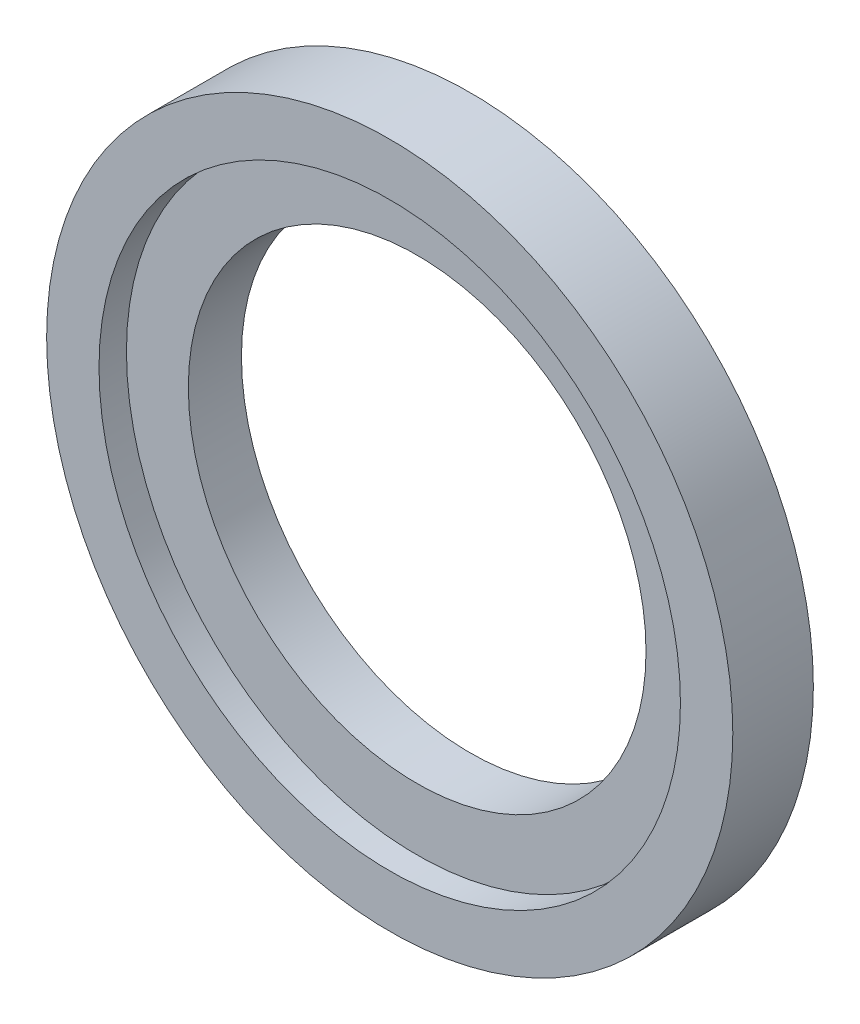
ISO-10303-21;
HEADER;
FILE_DESCRIPTION(('STEP AP214'),'2;1');
FILE_NAME('part.step','',(''),(''),'','','');
FILE_SCHEMA(('AUTOMOTIVE_DESIGN { 1 0 10303 214 1 1 1 1 }'));
ENDSEC;
DATA;
#1=APPLICATION_CONTEXT('core data for automotive mechanical design processes');
#2=APPLICATION_PROTOCOL_DEFINITION('international standard','automotive_design',2000,#1);
#3=PRODUCT_CONTEXT('',#1,'mechanical');
#4=PRODUCT('Part','Part','',(#3));
#5=PRODUCT_RELATED_PRODUCT_CATEGORY('part','',(#4));
#6=PRODUCT_DEFINITION_FORMATION('','',#4);
#7=PRODUCT_DEFINITION_CONTEXT('part definition',#1,'design');
#8=PRODUCT_DEFINITION('design','',#6,#7);
#9=PRODUCT_DEFINITION_SHAPE('','',#8);
#10=(LENGTH_UNIT() NAMED_UNIT(*) SI_UNIT(.MILLI.,.METRE.));
#11=(NAMED_UNIT(*) PLANE_ANGLE_UNIT() SI_UNIT($,.RADIAN.));
#12=(NAMED_UNIT(*) SI_UNIT($,.STERADIAN.) SOLID_ANGLE_UNIT());
#13=UNCERTAINTY_MEASURE_WITH_UNIT(LENGTH_MEASURE(1.E-05),#10,'distance_accuracy_value','');
#14=(GEOMETRIC_REPRESENTATION_CONTEXT(3) GLOBAL_UNCERTAINTY_ASSIGNED_CONTEXT((#13)) GLOBAL_UNIT_ASSIGNED_CONTEXT((#10,
#11,#12)) REPRESENTATION_CONTEXT('',''));
#15=CARTESIAN_POINT('',(0.,0.,0.));
#16=DIRECTION('',(0.,0.,1.));
#17=DIRECTION('',(1.,0.,0.));
#18=AXIS2_PLACEMENT_3D('',#15,#16,#17);
#19=CARTESIAN_POINT('',(0.,0.,5.87));
#20=DIRECTION('',(0.,0.,-1.));
#21=DIRECTION('',(-1.,0.,0.));
#22=AXIS2_PLACEMENT_3D('',#19,#20,#21);
#23=CYLINDRICAL_SURFACE('',#22,16.675);
#24=CARTESIAN_POINT('',(0.,0.,0.));
#25=DIRECTION('',(0.,0.,-1.));
#26=DIRECTION('',(-1.,0.,0.));
#27=AXIS2_PLACEMENT_3D('',#24,#25,#26);
#28=CIRCLE('',#27,16.675);
#29=CARTESIAN_POINT('',(-16.675,0.,0.));
#30=VERTEX_POINT('',#29);
#31=EDGE_CURVE('E44',#30,#30,#28,.T.);
#32=ORIENTED_EDGE('',*,*,#31,.T.);
#33=EDGE_LOOP('',(#32));
#34=FACE_BOUND('',#33,.T.);
#35=CARTESIAN_POINT('',(0.,0.,3.87));
#36=DIRECTION('',(0.,0.,1.));
#37=DIRECTION('',(1.,0.,0.));
#38=AXIS2_PLACEMENT_3D('',#35,#36,#37);
#39=CIRCLE('',#38,16.675);
#40=CARTESIAN_POINT('',(16.675,0.,3.87));
#41=VERTEX_POINT('',#40);
#42=EDGE_CURVE('E35',#41,#41,#39,.F.);
#43=ORIENTED_EDGE('',*,*,#42,.F.);
#44=EDGE_LOOP('',(#43));
#45=FACE_BOUND('',#44,.T.);
#46=ADVANCED_FACE('F31',(#34,#45),#23,.F.);
#47=CARTESIAN_POINT('',(0.,0.,5.87));
#48=DIRECTION('',(0.,0.,-1.));
#49=DIRECTION('',(-1.,0.,0.));
#50=AXIS2_PLACEMENT_3D('',#47,#48,#49);
#51=CYLINDRICAL_SURFACE('',#50,25.);
#52=CARTESIAN_POINT('',(0.,0.,5.87));
#53=DIRECTION('',(0.,0.,1.));
#54=DIRECTION('',(1.,0.,0.));
#55=AXIS2_PLACEMENT_3D('',#52,#53,#54);
#56=CIRCLE('',#55,25.);
#57=CARTESIAN_POINT('',(25.,0.,5.87));
#58=VERTEX_POINT('',#57);
#59=EDGE_CURVE('E10',#58,#58,#56,.T.);
#60=ORIENTED_EDGE('',*,*,#59,.F.);
#61=EDGE_LOOP('',(#60));
#62=FACE_BOUND('',#61,.T.);
#63=CARTESIAN_POINT('',(0.,0.,0.));
#64=DIRECTION('',(0.,0.,1.));
#65=DIRECTION('',(1.,0.,0.));
#66=AXIS2_PLACEMENT_3D('',#63,#64,#65);
#67=CIRCLE('',#66,25.);
#68=CARTESIAN_POINT('',(25.,0.,0.));
#69=VERTEX_POINT('',#68);
#70=EDGE_CURVE('E39',#69,#69,#67,.T.);
#71=ORIENTED_EDGE('',*,*,#70,.T.);
#72=EDGE_LOOP('',(#71));
#73=FACE_BOUND('',#72,.T.);
#74=ADVANCED_FACE('F33',(#62,#73),#51,.T.);
#75=CARTESIAN_POINT('',(0.,0.,5.87));
#76=DIRECTION('',(0.,0.,1.));
#77=DIRECTION('',(1.,0.,0.));
#78=AXIS2_PLACEMENT_3D('',#75,#76,#77);
#79=PLANE('',#78);
#80=CARTESIAN_POINT('',(0.,0.,5.87));
#81=DIRECTION('',(0.,0.,1.));
#82=DIRECTION('',(1.,0.,0.));
#83=AXIS2_PLACEMENT_3D('',#80,#81,#82);
#84=CIRCLE('',#83,21.1841325965168);
#85=CARTESIAN_POINT('',(21.1841325965168,0.,5.87));
#86=VERTEX_POINT('',#85);
#87=EDGE_CURVE('E48',#86,#86,#84,.T.);
#88=ORIENTED_EDGE('',*,*,#87,.F.);
#89=EDGE_LOOP('',(#88));
#90=FACE_BOUND('',#89,.T.);
#91=ORIENTED_EDGE('',*,*,#59,.T.);
#92=EDGE_LOOP('',(#91));
#93=FACE_BOUND('',#92,.T.);
#94=ADVANCED_FACE('F66',(#90,#93),#79,.T.);
#95=CARTESIAN_POINT('',(0.,0.,0.));
#96=DIRECTION('',(0.,0.,1.));
#97=DIRECTION('',(1.,0.,0.));
#98=AXIS2_PLACEMENT_3D('',#95,#96,#97);
#99=PLANE('',#98);
#100=ORIENTED_EDGE('',*,*,#31,.F.);
#101=EDGE_LOOP('',(#100));
#102=FACE_BOUND('',#101,.T.);
#103=ORIENTED_EDGE('',*,*,#70,.F.);
#104=EDGE_LOOP('',(#103));
#105=FACE_BOUND('',#104,.T.);
#106=ADVANCED_FACE('F73',(#102,#105),#99,.F.);
#107=CARTESIAN_POINT('',(0.,0.,3.87));
#108=DIRECTION('',(0.,0.,1.));
#109=DIRECTION('',(1.,0.,0.));
#110=AXIS2_PLACEMENT_3D('',#107,#108,#109);
#111=PLANE('',#110);
#112=CARTESIAN_POINT('',(0.,0.,3.87));
#113=DIRECTION('',(0.,0.,1.));
#114=DIRECTION('',(1.,0.,0.));
#115=AXIS2_PLACEMENT_3D('',#112,#113,#114);
#116=CIRCLE('',#115,21.1841325965168);
#117=CARTESIAN_POINT('',(21.1841325965168,0.,3.87));
#118=VERTEX_POINT('',#117);
#119=EDGE_CURVE('E51',#118,#118,#116,.T.);
#120=ORIENTED_EDGE('',*,*,#119,.T.);
#121=EDGE_LOOP('',(#120));
#122=FACE_BOUND('',#121,.T.);
#123=ORIENTED_EDGE('',*,*,#42,.T.);
#124=EDGE_LOOP('',(#123));
#125=FACE_BOUND('',#124,.T.);
#126=ADVANCED_FACE('F58',(#122,#125),#111,.T.);
#127=CARTESIAN_POINT('',(0.,0.,3.87));
#128=DIRECTION('',(0.,0.,1.));
#129=DIRECTION('',(1.,0.,0.));
#130=AXIS2_PLACEMENT_3D('',#127,#128,#129);
#131=CYLINDRICAL_SURFACE('',#130,21.1841325965168);
#132=ORIENTED_EDGE('',*,*,#119,.F.);
#133=EDGE_LOOP('',(#132));
#134=FACE_BOUND('',#133,.T.);
#135=ORIENTED_EDGE('',*,*,#87,.T.);
#136=EDGE_LOOP('',(#135));
#137=FACE_BOUND('',#136,.T.);
#138=ADVANCED_FACE('F70',(#134,#137),#131,.F.);
#139=CLOSED_SHELL('',(#46,#74,#94,#106,#126,#138));
#140=MANIFOLD_SOLID_BREP('B2',#139);
#141=ADVANCED_BREP_SHAPE_REPRESENTATION('',(#18,#140),#14);
#142=SHAPE_DEFINITION_REPRESENTATION(#9,#141);
ENDSEC;
END-ISO-10303-21;
